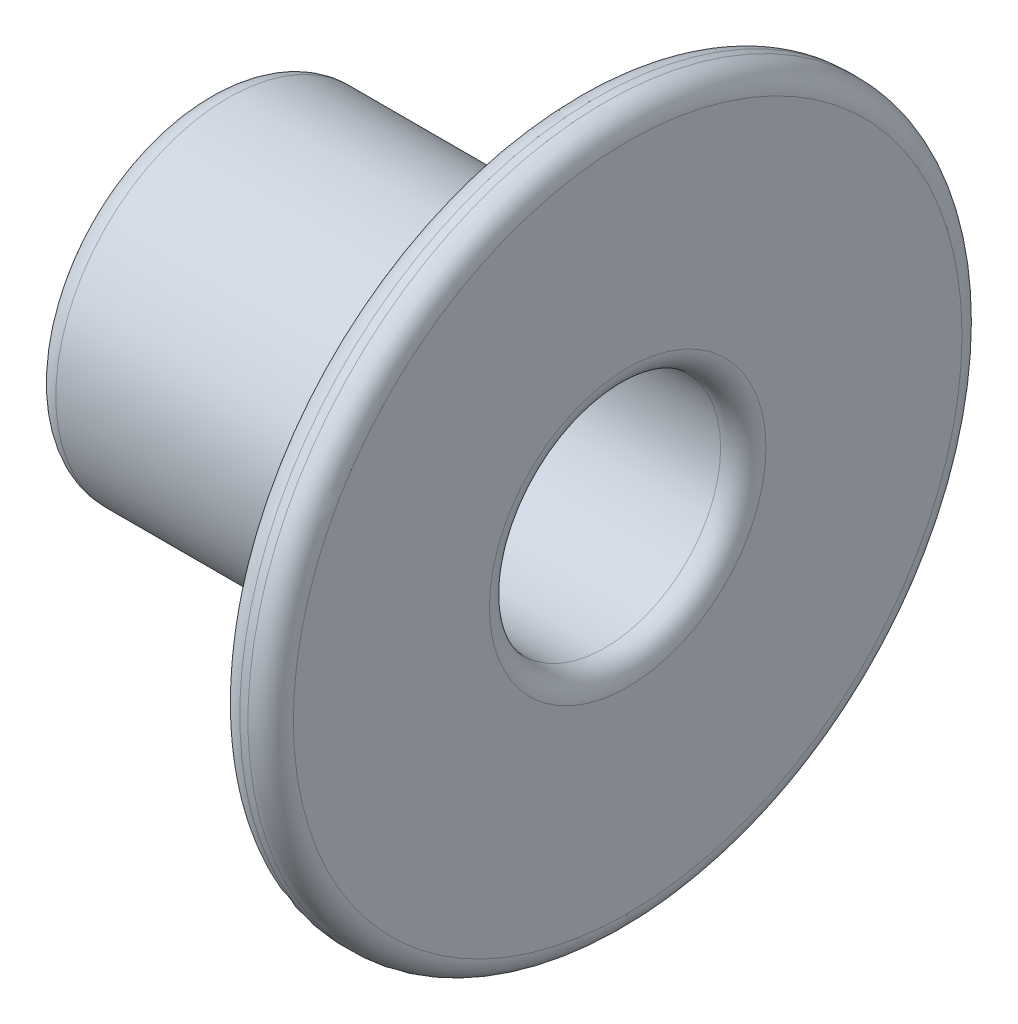
ISO-10303-21;
HEADER;
FILE_DESCRIPTION(('STEP AP214'),'2;1');
FILE_NAME('part.step','',(''),(''),'','','');
FILE_SCHEMA(('AUTOMOTIVE_DESIGN { 1 0 10303 214 1 1 1 1 }'));
ENDSEC;
DATA;
#1=APPLICATION_CONTEXT('core data for automotive mechanical design processes');
#2=APPLICATION_PROTOCOL_DEFINITION('international standard','automotive_design',2000,#1);
#3=PRODUCT_CONTEXT('',#1,'mechanical');
#4=PRODUCT('Part','Part','',(#3));
#5=PRODUCT_RELATED_PRODUCT_CATEGORY('part','',(#4));
#6=PRODUCT_DEFINITION_FORMATION('','',#4);
#7=PRODUCT_DEFINITION_CONTEXT('part definition',#1,'design');
#8=PRODUCT_DEFINITION('design','',#6,#7);
#9=PRODUCT_DEFINITION_SHAPE('','',#8);
#10=(LENGTH_UNIT() NAMED_UNIT(*) SI_UNIT(.MILLI.,.METRE.));
#11=(NAMED_UNIT(*) PLANE_ANGLE_UNIT() SI_UNIT($,.RADIAN.));
#12=(NAMED_UNIT(*) SI_UNIT($,.STERADIAN.) SOLID_ANGLE_UNIT());
#13=UNCERTAINTY_MEASURE_WITH_UNIT(LENGTH_MEASURE(1.E-05),#10,'distance_accuracy_value','');
#14=(GEOMETRIC_REPRESENTATION_CONTEXT(3) GLOBAL_UNCERTAINTY_ASSIGNED_CONTEXT((#13)) GLOBAL_UNIT_ASSIGNED_CONTEXT((#10,
#11,#12)) REPRESENTATION_CONTEXT('',''));
#15=CARTESIAN_POINT('',(0.,0.,0.));
#16=DIRECTION('',(0.,0.,1.));
#17=DIRECTION('',(1.,0.,0.));
#18=AXIS2_PLACEMENT_3D('',#15,#16,#17);
#19=CARTESIAN_POINT('',(-453.73,0.,0.));
#20=DIRECTION('',(1.,0.,0.));
#21=DIRECTION('',(0.,0.,-1.));
#22=AXIS2_PLACEMENT_3D('',#19,#20,#21);
#23=TOROIDAL_SURFACE('',#22,8.382,1.27);
#24=CARTESIAN_POINT('',(-455.,0.,0.));
#25=DIRECTION('',(1.,0.,0.));
#26=DIRECTION('',(0.,0.,-1.));
#27=AXIS2_PLACEMENT_3D('',#24,#25,#26);
#28=CIRCLE('',#27,8.38200000000006);
#29=CARTESIAN_POINT('',(-455.,0.,-8.38200000000006));
#30=VERTEX_POINT('',#29);
#31=EDGE_CURVE('E10',#30,#30,#28,.T.);
#32=ORIENTED_EDGE('',*,*,#31,.T.);
#33=EDGE_LOOP('',(#32));
#34=FACE_BOUND('',#33,.T.);
#35=CARTESIAN_POINT('',(-453.73,0.,0.));
#36=DIRECTION('',(1.,0.,0.));
#37=DIRECTION('',(0.,0.,-1.));
#38=AXIS2_PLACEMENT_3D('',#35,#36,#37);
#39=CIRCLE('',#38,9.652);
#40=CARTESIAN_POINT('',(-453.73,0.,-9.652));
#41=VERTEX_POINT('',#40);
#42=EDGE_CURVE('E72',#41,#41,#39,.T.);
#43=ORIENTED_EDGE('',*,*,#42,.F.);
#44=EDGE_LOOP('',(#43));
#45=FACE_BOUND('',#44,.T.);
#46=ADVANCED_FACE('F35',(#34,#45),#23,.T.);
#47=CARTESIAN_POINT('',(-455.,8.38200000000006,0.));
#48=DIRECTION('',(-1.,0.,0.));
#49=DIRECTION('',(0.,0.,1.));
#50=AXIS2_PLACEMENT_3D('',#47,#48,#49);
#51=PLANE('',#50);
#52=ORIENTED_EDGE('',*,*,#31,.F.);
#53=EDGE_LOOP('',(#52));
#54=FACE_BOUND('',#53,.T.);
#55=ADVANCED_FACE('F80',(#54),#51,.T.);
#56=CARTESIAN_POINT('',(-450.,0.,0.));
#57=DIRECTION('',(1.,0.,0.));
#58=DIRECTION('',(0.,0.,-1.));
#59=AXIS2_PLACEMENT_3D('',#56,#57,#58);
#60=PLANE('',#59);
#61=CARTESIAN_POINT('',(-450.,0.,0.));
#62=DIRECTION('',(1.,0.,0.));
#63=DIRECTION('',(0.,0.,-1.));
#64=AXIS2_PLACEMENT_3D('',#61,#62,#63);
#65=CIRCLE('',#64,6.477);
#66=CARTESIAN_POINT('',(-450.,0.,-6.477));
#67=VERTEX_POINT('',#66);
#68=EDGE_CURVE('E41',#67,#67,#65,.T.);
#69=ORIENTED_EDGE('',*,*,#68,.T.);
#70=EDGE_LOOP('',(#69));
#71=FACE_BOUND('',#70,.T.);
#72=ADVANCED_FACE('F84',(#71),#60,.T.);
#73=CARTESIAN_POINT('',(-455.001250002235,0.,0.));
#74=DIRECTION('',(1.,0.,0.));
#75=DIRECTION('',(0.,0.,-1.));
#76=AXIS2_PLACEMENT_3D('',#73,#74,#75);
#77=CYLINDRICAL_SURFACE('',#76,6.477);
#78=CARTESIAN_POINT('',(-432.61241397916,0.,0.));
#79=DIRECTION('',(1.,0.,0.));
#80=DIRECTION('',(0.,0.,-1.));
#81=AXIS2_PLACEMENT_3D('',#78,#79,#80);
#82=CIRCLE('',#81,6.477);
#83=CARTESIAN_POINT('',(-432.61241397916,0.,-6.477));
#84=VERTEX_POINT('',#83);
#85=EDGE_CURVE('E45',#84,#84,#82,.T.);
#86=ORIENTED_EDGE('',*,*,#85,.T.);
#87=EDGE_LOOP('',(#86));
#88=FACE_BOUND('',#87,.T.);
#89=ORIENTED_EDGE('',*,*,#68,.F.);
#90=EDGE_LOOP('',(#89));
#91=FACE_BOUND('',#90,.T.);
#92=ADVANCED_FACE('F89',(#88,#91),#77,.F.);
#93=CARTESIAN_POINT('',(-432.61241397916,0.,0.));
#94=DIRECTION('',(1.,0.,0.));
#95=DIRECTION('',(0.,0.,-1.));
#96=AXIS2_PLACEMENT_3D('',#93,#94,#95);
#97=TOROIDAL_SURFACE('',#96,7.747,1.27);
#98=CARTESIAN_POINT('',(-431.34241397916,0.,0.));
#99=DIRECTION('',(1.,0.,0.));
#100=DIRECTION('',(0.,0.,-1.));
#101=AXIS2_PLACEMENT_3D('',#98,#99,#100);
#102=CIRCLE('',#101,7.747);
#103=CARTESIAN_POINT('',(-431.34241397916,0.,-7.747));
#104=VERTEX_POINT('',#103);
#105=EDGE_CURVE('E49',#104,#104,#102,.T.);
#106=ORIENTED_EDGE('',*,*,#105,.T.);
#107=EDGE_LOOP('',(#106));
#108=FACE_BOUND('',#107,.T.);
#109=ORIENTED_EDGE('',*,*,#85,.F.);
#110=EDGE_LOOP('',(#109));
#111=FACE_BOUND('',#110,.T.);
#112=ADVANCED_FACE('F94',(#108,#111),#97,.T.);
#113=CARTESIAN_POINT('',(-431.34241397916,7.747,0.));
#114=DIRECTION('',(1.,0.,0.));
#115=DIRECTION('',(0.,0.,-1.));
#116=AXIS2_PLACEMENT_3D('',#113,#114,#115);
#117=PLANE('',#116);
#118=CARTESIAN_POINT('',(-431.34241397916,0.,0.));
#119=DIRECTION('',(1.,0.,0.));
#120=DIRECTION('',(0.,0.,-1.));
#121=AXIS2_PLACEMENT_3D('',#118,#119,#120);
#122=CIRCLE('',#121,18.73);
#123=CARTESIAN_POINT('',(-431.34241397916,0.,-18.73));
#124=VERTEX_POINT('',#123);
#125=EDGE_CURVE('E54',#124,#124,#122,.T.);
#126=ORIENTED_EDGE('',*,*,#125,.T.);
#127=EDGE_LOOP('',(#126));
#128=FACE_BOUND('',#127,.T.);
#129=ORIENTED_EDGE('',*,*,#105,.F.);
#130=EDGE_LOOP('',(#129));
#131=FACE_BOUND('',#130,.T.);
#132=ADVANCED_FACE('F98',(#128,#131),#117,.T.);
#133=CARTESIAN_POINT('',(-432.61241397916,0.,0.));
#134=DIRECTION('',(1.,0.,0.));
#135=DIRECTION('',(0.,0.,-1.));
#136=AXIS2_PLACEMENT_3D('',#133,#134,#135);
#137=TOROIDAL_SURFACE('',#136,18.73,1.27);
#138=CARTESIAN_POINT('',(-432.61241397916,0.,0.));
#139=DIRECTION('',(1.,0.,0.));
#140=DIRECTION('',(0.,0.,-1.));
#141=AXIS2_PLACEMENT_3D('',#138,#139,#140);
#142=CIRCLE('',#141,20.);
#143=CARTESIAN_POINT('',(-432.61241397916,0.,-20.));
#144=VERTEX_POINT('',#143);
#145=EDGE_CURVE('E57',#144,#144,#142,.T.);
#146=ORIENTED_EDGE('',*,*,#145,.T.);
#147=EDGE_LOOP('',(#146));
#148=FACE_BOUND('',#147,.T.);
#149=ORIENTED_EDGE('',*,*,#125,.F.);
#150=EDGE_LOOP('',(#149));
#151=FACE_BOUND('',#150,.T.);
#152=ADVANCED_FACE('F102',(#148,#151),#137,.T.);
#153=CARTESIAN_POINT('',(-455.001250002235,0.,0.));
#154=DIRECTION('',(1.,0.,0.));
#155=DIRECTION('',(0.,0.,-1.));
#156=AXIS2_PLACEMENT_3D('',#153,#154,#155);
#157=CYLINDRICAL_SURFACE('',#156,20.);
#158=CARTESIAN_POINT('',(-433.07241397916,0.,0.));
#159=DIRECTION('',(1.,0.,0.));
#160=DIRECTION('',(0.,0.,-1.));
#161=AXIS2_PLACEMENT_3D('',#158,#159,#160);
#162=CIRCLE('',#161,20.);
#163=CARTESIAN_POINT('',(-433.07241397916,0.,-20.));
#164=VERTEX_POINT('',#163);
#165=EDGE_CURVE('E60',#164,#164,#162,.T.);
#166=ORIENTED_EDGE('',*,*,#165,.T.);
#167=EDGE_LOOP('',(#166));
#168=FACE_BOUND('',#167,.T.);
#169=ORIENTED_EDGE('',*,*,#145,.F.);
#170=EDGE_LOOP('',(#169));
#171=FACE_BOUND('',#170,.T.);
#172=ADVANCED_FACE('F106',(#168,#171),#157,.T.);
#173=CARTESIAN_POINT('',(-433.07241397916,0.,0.));
#174=DIRECTION('',(1.,0.,0.));
#175=DIRECTION('',(0.,0.,-1.));
#176=AXIS2_PLACEMENT_3D('',#173,#174,#175);
#177=TOROIDAL_SURFACE('',#176,18.73,1.27);
#178=CARTESIAN_POINT('',(-434.34241397916,0.,0.));
#179=DIRECTION('',(1.,0.,0.));
#180=DIRECTION('',(0.,0.,-1.));
#181=AXIS2_PLACEMENT_3D('',#178,#179,#180);
#182=CIRCLE('',#181,18.73);
#183=CARTESIAN_POINT('',(-434.34241397916,0.,-18.73));
#184=VERTEX_POINT('',#183);
#185=EDGE_CURVE('E63',#184,#184,#182,.T.);
#186=ORIENTED_EDGE('',*,*,#185,.T.);
#187=EDGE_LOOP('',(#186));
#188=FACE_BOUND('',#187,.T.);
#189=ORIENTED_EDGE('',*,*,#165,.F.);
#190=EDGE_LOOP('',(#189));
#191=FACE_BOUND('',#190,.T.);
#192=ADVANCED_FACE('F110',(#188,#191),#177,.T.);
#193=CARTESIAN_POINT('',(-434.34241397916,18.73,0.));
#194=DIRECTION('',(-1.,0.,0.));
#195=DIRECTION('',(0.,0.,1.));
#196=AXIS2_PLACEMENT_3D('',#193,#194,#195);
#197=PLANE('',#196);
#198=CARTESIAN_POINT('',(-434.34241397916,0.,0.));
#199=DIRECTION('',(1.,0.,0.));
#200=DIRECTION('',(0.,0.,-1.));
#201=AXIS2_PLACEMENT_3D('',#198,#199,#200);
#202=CIRCLE('',#201,11.652);
#203=CARTESIAN_POINT('',(-434.34241397916,0.,-11.652));
#204=VERTEX_POINT('',#203);
#205=EDGE_CURVE('E66',#204,#204,#202,.T.);
#206=ORIENTED_EDGE('',*,*,#205,.T.);
#207=EDGE_LOOP('',(#206));
#208=FACE_BOUND('',#207,.T.);
#209=ORIENTED_EDGE('',*,*,#185,.F.);
#210=EDGE_LOOP('',(#209));
#211=FACE_BOUND('',#210,.T.);
#212=ADVANCED_FACE('F114',(#208,#211),#197,.T.);
#213=CARTESIAN_POINT('',(-436.34241397916,0.,0.));
#214=DIRECTION('',(1.,0.,0.));
#215=DIRECTION('',(0.,0.,-1.));
#216=AXIS2_PLACEMENT_3D('',#213,#214,#215);
#217=TOROIDAL_SURFACE('',#216,11.652,2.);
#218=CARTESIAN_POINT('',(-436.34241397916,0.,0.));
#219=DIRECTION('',(1.,0.,0.));
#220=DIRECTION('',(0.,0.,-1.));
#221=AXIS2_PLACEMENT_3D('',#218,#219,#220);
#222=CIRCLE('',#221,9.652);
#223=CARTESIAN_POINT('',(-436.34241397916,0.,-9.652));
#224=VERTEX_POINT('',#223);
#225=EDGE_CURVE('E69',#224,#224,#222,.T.);
#226=ORIENTED_EDGE('',*,*,#225,.T.);
#227=EDGE_LOOP('',(#226));
#228=FACE_BOUND('',#227,.T.);
#229=ORIENTED_EDGE('',*,*,#205,.F.);
#230=EDGE_LOOP('',(#229));
#231=FACE_BOUND('',#230,.T.);
#232=ADVANCED_FACE('F118',(#228,#231),#217,.F.);
#233=CARTESIAN_POINT('',(-455.001250002235,0.,0.));
#234=DIRECTION('',(1.,0.,0.));
#235=DIRECTION('',(0.,0.,-1.));
#236=AXIS2_PLACEMENT_3D('',#233,#234,#235);
#237=CYLINDRICAL_SURFACE('',#236,9.652);
#238=ORIENTED_EDGE('',*,*,#42,.T.);
#239=EDGE_LOOP('',(#238));
#240=FACE_BOUND('',#239,.T.);
#241=ORIENTED_EDGE('',*,*,#225,.F.);
#242=EDGE_LOOP('',(#241));
#243=FACE_BOUND('',#242,.T.);
#244=ADVANCED_FACE('F76',(#240,#243),#237,.T.);
#245=CLOSED_SHELL('',(#46,#55,#72,#92,#112,#132,#152,#172,#192,#212,#232,#244));
#246=MANIFOLD_SOLID_BREP('B2',#245);
#247=ADVANCED_BREP_SHAPE_REPRESENTATION('',(#18,#246),#14);
#248=SHAPE_DEFINITION_REPRESENTATION(#9,#247);
ENDSEC;
END-ISO-10303-21;
